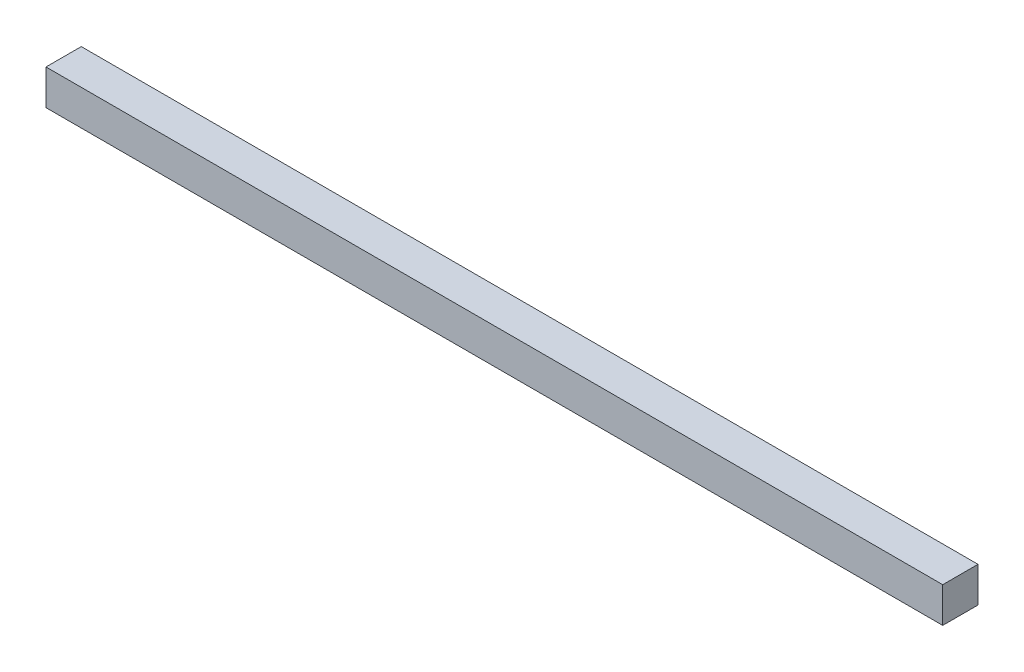
ISO-10303-21;
HEADER;
FILE_DESCRIPTION(('STEP AP214'),'2;1');
FILE_NAME('part.step','',(''),(''),'','','');
FILE_SCHEMA(('AUTOMOTIVE_DESIGN { 1 0 10303 214 1 1 1 1 }'));
ENDSEC;
DATA;
#1=APPLICATION_CONTEXT('core data for automotive mechanical design processes');
#2=APPLICATION_PROTOCOL_DEFINITION('international standard','automotive_design',2000,#1);
#3=PRODUCT_CONTEXT('',#1,'mechanical');
#4=PRODUCT('Part','Part','',(#3));
#5=PRODUCT_RELATED_PRODUCT_CATEGORY('part','',(#4));
#6=PRODUCT_DEFINITION_FORMATION('','',#4);
#7=PRODUCT_DEFINITION_CONTEXT('part definition',#1,'design');
#8=PRODUCT_DEFINITION('design','',#6,#7);
#9=PRODUCT_DEFINITION_SHAPE('','',#8);
#10=(LENGTH_UNIT() NAMED_UNIT(*) SI_UNIT(.MILLI.,.METRE.));
#11=(NAMED_UNIT(*) PLANE_ANGLE_UNIT() SI_UNIT($,.RADIAN.));
#12=(NAMED_UNIT(*) SI_UNIT($,.STERADIAN.) SOLID_ANGLE_UNIT());
#13=UNCERTAINTY_MEASURE_WITH_UNIT(LENGTH_MEASURE(1.E-05),#10,'distance_accuracy_value','');
#14=(GEOMETRIC_REPRESENTATION_CONTEXT(3) GLOBAL_UNCERTAINTY_ASSIGNED_CONTEXT((#13)) GLOBAL_UNIT_ASSIGNED_CONTEXT((#10,
#11,#12)) REPRESENTATION_CONTEXT('',''));
#15=CARTESIAN_POINT('',(0.,0.,0.));
#16=DIRECTION('',(0.,0.,1.));
#17=DIRECTION('',(1.,0.,0.));
#18=AXIS2_PLACEMENT_3D('',#15,#16,#17);
#19=CARTESIAN_POINT('',(0.,0.,3.));
#20=DIRECTION('',(1.,0.,0.));
#21=DIRECTION('',(0.,0.,-1.));
#22=AXIS2_PLACEMENT_3D('',#19,#20,#21);
#23=PLANE('',#22);
#24=DIRECTION('',(0.,-1.,0.));
#25=VECTOR('',#24,1.);
#26=CARTESIAN_POINT('',(0.,0.,0.));
#27=LINE('',#26,#25);
#28=CARTESIAN_POINT('',(0.,3.,0.));
#29=VERTEX_POINT('',#28);
#30=CARTESIAN_POINT('',(0.,0.,0.));
#31=VERTEX_POINT('',#30);
#32=EDGE_CURVE('E96',#29,#31,#27,.T.);
#33=ORIENTED_EDGE('',*,*,#32,.T.);
#34=DIRECTION('',(0.,0.,-1.));
#35=VECTOR('',#34,1.);
#36=CARTESIAN_POINT('',(0.,0.,3.));
#37=LINE('',#36,#35);
#38=CARTESIAN_POINT('',(0.,0.,3.));
#39=VERTEX_POINT('',#38);
#40=EDGE_CURVE('E11',#39,#31,#37,.T.);
#41=ORIENTED_EDGE('',*,*,#40,.F.);
#42=DIRECTION('',(0.,-1.,0.));
#43=VECTOR('',#42,1.);
#44=CARTESIAN_POINT('',(0.,0.,3.));
#45=LINE('',#44,#43);
#46=CARTESIAN_POINT('',(0.,3.,3.));
#47=VERTEX_POINT('',#46);
#48=EDGE_CURVE('E84',#47,#39,#45,.T.);
#49=ORIENTED_EDGE('',*,*,#48,.F.);
#50=DIRECTION('',(0.,0.,-1.));
#51=VECTOR('',#50,1.);
#52=CARTESIAN_POINT('',(0.,3.,3.));
#53=LINE('',#52,#51);
#54=EDGE_CURVE('E92',#47,#29,#53,.T.);
#55=ORIENTED_EDGE('',*,*,#54,.T.);
#56=EDGE_LOOP('',(#33,#41,#49,#55));
#57=FACE_BOUND('',#56,.T.);
#58=ADVANCED_FACE('F33',(#57),#23,.F.);
#59=CARTESIAN_POINT('',(0.,0.,3.));
#60=DIRECTION('',(0.,1.,0.));
#61=DIRECTION('',(0.,0.,1.));
#62=AXIS2_PLACEMENT_3D('',#59,#60,#61);
#63=PLANE('',#62);
#64=DIRECTION('',(1.,0.,0.));
#65=VECTOR('',#64,1.);
#66=CARTESIAN_POINT('',(0.,0.,0.));
#67=LINE('',#66,#65);
#68=CARTESIAN_POINT('',(76.25,0.,0.));
#69=VERTEX_POINT('',#68);
#70=EDGE_CURVE('E88',#31,#69,#67,.T.);
#71=ORIENTED_EDGE('',*,*,#70,.T.);
#72=DIRECTION('',(0.,0.,-1.));
#73=VECTOR('',#72,1.);
#74=CARTESIAN_POINT('',(76.25,0.,3.));
#75=LINE('',#74,#73);
#76=CARTESIAN_POINT('',(76.25,0.,3.));
#77=VERTEX_POINT('',#76);
#78=EDGE_CURVE('E41',#77,#69,#75,.T.);
#79=ORIENTED_EDGE('',*,*,#78,.F.);
#80=DIRECTION('',(1.,0.,0.));
#81=VECTOR('',#80,1.);
#82=CARTESIAN_POINT('',(0.,0.,3.));
#83=LINE('',#82,#81);
#84=EDGE_CURVE('E79',#39,#77,#83,.T.);
#85=ORIENTED_EDGE('',*,*,#84,.F.);
#86=ORIENTED_EDGE('',*,*,#40,.T.);
#87=EDGE_LOOP('',(#71,#79,#85,#86));
#88=FACE_BOUND('',#87,.T.);
#89=ADVANCED_FACE('F87',(#88),#63,.F.);
#90=CARTESIAN_POINT('',(76.25,0.,3.));
#91=DIRECTION('',(-1.,0.,0.));
#92=DIRECTION('',(0.,0.,1.));
#93=AXIS2_PLACEMENT_3D('',#90,#91,#92);
#94=PLANE('',#93);
#95=DIRECTION('',(0.,1.,0.));
#96=VECTOR('',#95,1.);
#97=CARTESIAN_POINT('',(76.25,0.,0.));
#98=LINE('',#97,#96);
#99=CARTESIAN_POINT('',(76.25,3.,0.));
#100=VERTEX_POINT('',#99);
#101=EDGE_CURVE('E66',#69,#100,#98,.T.);
#102=ORIENTED_EDGE('',*,*,#101,.T.);
#103=DIRECTION('',(0.,0.,-1.));
#104=VECTOR('',#103,1.);
#105=CARTESIAN_POINT('',(76.25,3.,3.));
#106=LINE('',#105,#104);
#107=CARTESIAN_POINT('',(76.25,3.,3.));
#108=VERTEX_POINT('',#107);
#109=EDGE_CURVE('E89',#108,#100,#106,.T.);
#110=ORIENTED_EDGE('',*,*,#109,.F.);
#111=DIRECTION('',(0.,1.,0.));
#112=VECTOR('',#111,1.);
#113=CARTESIAN_POINT('',(76.25,0.,3.));
#114=LINE('',#113,#112);
#115=EDGE_CURVE('E82',#77,#108,#114,.T.);
#116=ORIENTED_EDGE('',*,*,#115,.F.);
#117=ORIENTED_EDGE('',*,*,#78,.T.);
#118=EDGE_LOOP('',(#102,#110,#116,#117));
#119=FACE_BOUND('',#118,.T.);
#120=ADVANCED_FACE('F90',(#119),#94,.F.);
#121=CARTESIAN_POINT('',(0.,3.,3.));
#122=DIRECTION('',(0.,-1.,0.));
#123=DIRECTION('',(0.,0.,-1.));
#124=AXIS2_PLACEMENT_3D('',#121,#122,#123);
#125=PLANE('',#124);
#126=DIRECTION('',(-1.,0.,0.));
#127=VECTOR('',#126,1.);
#128=CARTESIAN_POINT('',(0.,3.,0.));
#129=LINE('',#128,#127);
#130=EDGE_CURVE('E72',#100,#29,#129,.T.);
#131=ORIENTED_EDGE('',*,*,#130,.T.);
#132=ORIENTED_EDGE('',*,*,#54,.F.);
#133=DIRECTION('',(-1.,0.,0.));
#134=VECTOR('',#133,1.);
#135=CARTESIAN_POINT('',(0.,3.,3.));
#136=LINE('',#135,#134);
#137=EDGE_CURVE('E49',#108,#47,#136,.T.);
#138=ORIENTED_EDGE('',*,*,#137,.F.);
#139=ORIENTED_EDGE('',*,*,#109,.T.);
#140=EDGE_LOOP('',(#131,#132,#138,#139));
#141=FACE_BOUND('',#140,.T.);
#142=ADVANCED_FACE('F103',(#141),#125,.F.);
#143=CARTESIAN_POINT('',(0.,0.,3.));
#144=DIRECTION('',(0.,0.,-1.));
#145=DIRECTION('',(-1.,0.,0.));
#146=AXIS2_PLACEMENT_3D('',#143,#144,#145);
#147=PLANE('',#146);
#148=ORIENTED_EDGE('',*,*,#48,.T.);
#149=ORIENTED_EDGE('',*,*,#84,.T.);
#150=ORIENTED_EDGE('',*,*,#115,.T.);
#151=ORIENTED_EDGE('',*,*,#137,.T.);
#152=EDGE_LOOP('',(#148,#149,#150,#151));
#153=FACE_BOUND('',#152,.T.);
#154=ADVANCED_FACE('F80',(#153),#147,.F.);
#155=CARTESIAN_POINT('',(0.,0.,0.));
#156=DIRECTION('',(0.,0.,-1.));
#157=DIRECTION('',(-1.,0.,0.));
#158=AXIS2_PLACEMENT_3D('',#155,#156,#157);
#159=PLANE('',#158);
#160=ORIENTED_EDGE('',*,*,#32,.F.);
#161=ORIENTED_EDGE('',*,*,#130,.F.);
#162=ORIENTED_EDGE('',*,*,#101,.F.);
#163=ORIENTED_EDGE('',*,*,#70,.F.);
#164=EDGE_LOOP('',(#160,#161,#162,#163));
#165=FACE_BOUND('',#164,.T.);
#166=ADVANCED_FACE('F106',(#165),#159,.T.);
#167=CLOSED_SHELL('',(#58,#89,#120,#142,#154,#166));
#168=MANIFOLD_SOLID_BREP('B2',#167);
#169=ADVANCED_BREP_SHAPE_REPRESENTATION('',(#18,#168),#14);
#170=SHAPE_DEFINITION_REPRESENTATION(#9,#169);
ENDSEC;
END-ISO-10303-21;
